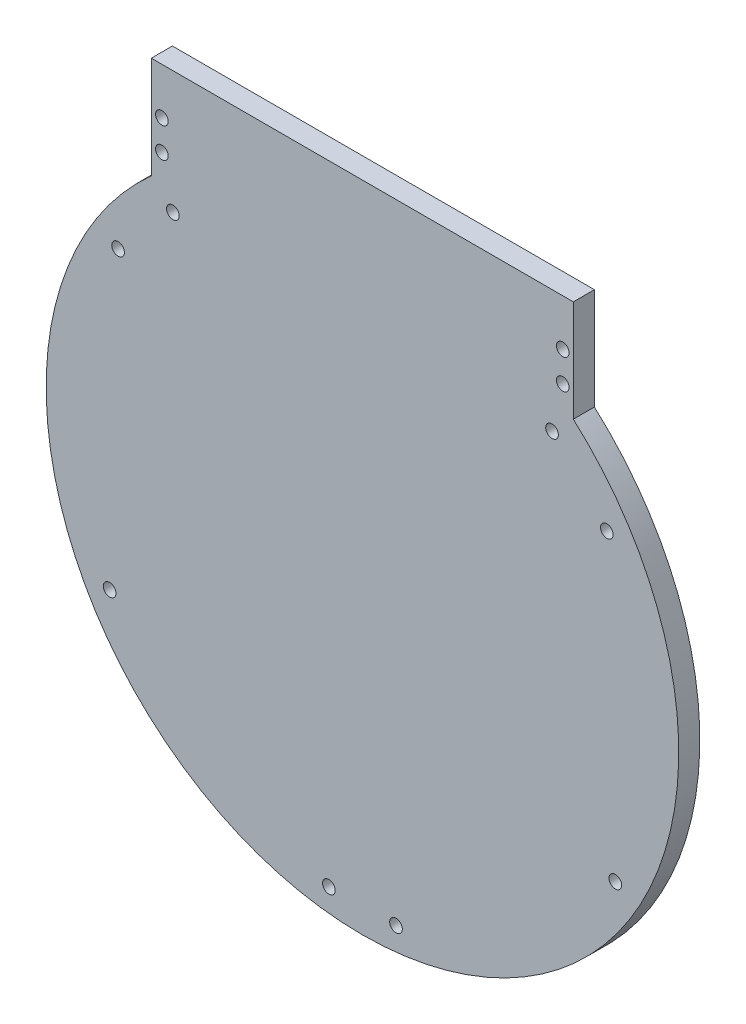
ISO-10303-21;
HEADER;
FILE_DESCRIPTION(('STEP AP214'),'2;1');
FILE_NAME('part.step','',(''),(''),'','','');
FILE_SCHEMA(('AUTOMOTIVE_DESIGN { 1 0 10303 214 1 1 1 1 }'));
ENDSEC;
DATA;
#1=APPLICATION_CONTEXT('core data for automotive mechanical design processes');
#2=APPLICATION_PROTOCOL_DEFINITION('international standard','automotive_design',2000,#1);
#3=PRODUCT_CONTEXT('',#1,'mechanical');
#4=PRODUCT('Part','Part','',(#3));
#5=PRODUCT_RELATED_PRODUCT_CATEGORY('part','',(#4));
#6=PRODUCT_DEFINITION_FORMATION('','',#4);
#7=PRODUCT_DEFINITION_CONTEXT('part definition',#1,'design');
#8=PRODUCT_DEFINITION('design','',#6,#7);
#9=PRODUCT_DEFINITION_SHAPE('','',#8);
#10=(LENGTH_UNIT() NAMED_UNIT(*) SI_UNIT(.MILLI.,.METRE.));
#11=(NAMED_UNIT(*) PLANE_ANGLE_UNIT() SI_UNIT($,.RADIAN.));
#12=(NAMED_UNIT(*) SI_UNIT($,.STERADIAN.) SOLID_ANGLE_UNIT());
#13=UNCERTAINTY_MEASURE_WITH_UNIT(LENGTH_MEASURE(1.E-05),#10,'distance_accuracy_value','');
#14=(GEOMETRIC_REPRESENTATION_CONTEXT(3) GLOBAL_UNCERTAINTY_ASSIGNED_CONTEXT((#13)) GLOBAL_UNIT_ASSIGNED_CONTEXT((#10,
#11,#12)) REPRESENTATION_CONTEXT('',''));
#15=CARTESIAN_POINT('',(0.,0.,0.));
#16=DIRECTION('',(0.,0.,1.));
#17=DIRECTION('',(1.,0.,0.));
#18=AXIS2_PLACEMENT_3D('',#15,#16,#17);
#19=CARTESIAN_POINT('',(-55.5045945388852,-168.430491325062,5.));
#20=DIRECTION('',(-0.478016960582072,-0.878350605052378,0.));
#21=DIRECTION('',(0.878350605052378,-0.478016960582072,0.));
#22=AXIS2_PLACEMENT_3D('',#19,#20,#21);
#23=PLANE('',#22);
#24=DIRECTION('',(-0.878350605052378,0.478016960582072,0.));
#25=VECTOR('',#24,1.);
#26=CARTESIAN_POINT('',(-55.5045945388852,-168.430491325062,0.));
#27=LINE('',#26,#25);
#28=CARTESIAN_POINT('',(-55.5045945388852,-168.430491325062,0.));
#29=VERTEX_POINT('',#28);
#30=CARTESIAN_POINT('',(-55.5733514009686,-168.393072387746,0.));
#31=VERTEX_POINT('',#30);
#32=EDGE_CURVE('E116',#29,#31,#27,.T.);
#33=ORIENTED_EDGE('',*,*,#32,.F.);
#34=DIRECTION('',(0.,0.,-1.));
#35=VECTOR('',#34,1.);
#36=CARTESIAN_POINT('',(-55.5045945388852,-168.430491325062,5.));
#37=LINE('',#36,#35);
#38=CARTESIAN_POINT('',(-55.5045945388852,-168.430491325062,5.));
#39=VERTEX_POINT('',#38);
#40=EDGE_CURVE('E11',#39,#29,#37,.T.);
#41=ORIENTED_EDGE('',*,*,#40,.F.);
#42=DIRECTION('',(-0.878350605052378,0.478016960582072,0.));
#43=VECTOR('',#42,1.);
#44=CARTESIAN_POINT('',(-55.5045945388852,-168.430491325062,5.));
#45=LINE('',#44,#43);
#46=CARTESIAN_POINT('',(-55.5733514009686,-168.393072387746,5.));
#47=VERTEX_POINT('',#46);
#48=EDGE_CURVE('E111',#39,#47,#45,.T.);
#49=ORIENTED_EDGE('',*,*,#48,.T.);
#50=DIRECTION('',(0.,0.,-1.));
#51=VECTOR('',#50,1.);
#52=CARTESIAN_POINT('',(-55.5733514009686,-168.393072387746,5.));
#53=LINE('',#52,#51);
#54=EDGE_CURVE('E81',#47,#31,#53,.T.);
#55=ORIENTED_EDGE('',*,*,#54,.T.);
#56=EDGE_LOOP('',(#33,#41,#49,#55));
#57=FACE_BOUND('',#56,.T.);
#58=ADVANCED_FACE('F36',(#57),#23,.T.);
#59=CARTESIAN_POINT('',(-5.50459453888519,-224.332190762557,5.));
#60=DIRECTION('',(0.,0.,-1.));
#61=DIRECTION('',(-1.,0.,0.));
#62=AXIS2_PLACEMENT_3D('',#59,#60,#61);
#63=CYLINDRICAL_SURFACE('',#62,75.);
#64=CARTESIAN_POINT('',(-5.50459453888519,-224.332190762557,0.));
#65=DIRECTION('',(0.,0.,1.));
#66=DIRECTION('',(1.,0.,0.));
#67=AXIS2_PLACEMENT_3D('',#64,#65,#66);
#68=CIRCLE('',#67,75.);
#69=CARTESIAN_POINT('',(44.4954054611148,-168.430491325062,0.));
#70=VERTEX_POINT('',#69);
#71=EDGE_CURVE('E72',#29,#70,#68,.T.);
#72=ORIENTED_EDGE('',*,*,#71,.T.);
#73=DIRECTION('',(0.,0.,-1.));
#74=VECTOR('',#73,1.);
#75=CARTESIAN_POINT('',(44.4954054611148,-168.430491325062,5.));
#76=LINE('',#75,#74);
#77=CARTESIAN_POINT('',(44.4954054611148,-168.430491325062,5.));
#78=VERTEX_POINT('',#77);
#79=EDGE_CURVE('E45',#78,#70,#76,.T.);
#80=ORIENTED_EDGE('',*,*,#79,.F.);
#81=CARTESIAN_POINT('',(-5.50459453888519,-224.332190762557,5.));
#82=DIRECTION('',(0.,0.,1.));
#83=DIRECTION('',(1.,0.,0.));
#84=AXIS2_PLACEMENT_3D('',#81,#82,#83);
#85=CIRCLE('',#84,75.);
#86=EDGE_CURVE('E95',#39,#78,#85,.T.);
#87=ORIENTED_EDGE('',*,*,#86,.F.);
#88=ORIENTED_EDGE('',*,*,#40,.T.);
#89=EDGE_LOOP('',(#72,#80,#87,#88));
#90=FACE_BOUND('',#89,.T.);
#91=ADVANCED_FACE('F181',(#90),#63,.T.);
#92=CARTESIAN_POINT('',(44.4954054611148,-168.430491325062,5.));
#93=DIRECTION('',(-1.,0.,0.));
#94=DIRECTION('',(0.,-1.,0.));
#95=AXIS2_PLACEMENT_3D('',#92,#93,#94);
#96=PLANE('',#95);
#97=DIRECTION('',(0.,1.,0.));
#98=VECTOR('',#97,1.);
#99=CARTESIAN_POINT('',(44.4954054611148,-168.430491325062,0.));
#100=LINE('',#99,#98);
#101=CARTESIAN_POINT('',(44.4954054611148,-144.332190762557,0.));
#102=VERTEX_POINT('',#101);
#103=EDGE_CURVE('E102',#70,#102,#100,.T.);
#104=ORIENTED_EDGE('',*,*,#103,.T.);
#105=DIRECTION('',(0.,0.,-1.));
#106=VECTOR('',#105,1.);
#107=CARTESIAN_POINT('',(44.4954054611148,-144.332190762557,5.));
#108=LINE('',#107,#106);
#109=CARTESIAN_POINT('',(44.4954054611148,-144.332190762557,5.));
#110=VERTEX_POINT('',#109);
#111=EDGE_CURVE('E99',#110,#102,#108,.T.);
#112=ORIENTED_EDGE('',*,*,#111,.F.);
#113=DIRECTION('',(0.,1.,0.));
#114=VECTOR('',#113,1.);
#115=CARTESIAN_POINT('',(44.4954054611148,-168.430491325062,5.));
#116=LINE('',#115,#114);
#117=EDGE_CURVE('E89',#78,#110,#116,.T.);
#118=ORIENTED_EDGE('',*,*,#117,.F.);
#119=ORIENTED_EDGE('',*,*,#79,.T.);
#120=EDGE_LOOP('',(#104,#112,#118,#119));
#121=FACE_BOUND('',#120,.T.);
#122=ADVANCED_FACE('F100',(#121),#96,.F.);
#123=CARTESIAN_POINT('',(-55.5733514009686,-144.332190762557,5.));
#124=DIRECTION('',(0.,1.,0.));
#125=DIRECTION('',(0.,0.,1.));
#126=AXIS2_PLACEMENT_3D('',#123,#124,#125);
#127=PLANE('',#126);
#128=DIRECTION('',(1.,0.,0.));
#129=VECTOR('',#128,1.);
#130=CARTESIAN_POINT('',(-55.5733514009686,-144.332190762557,0.));
#131=LINE('',#130,#129);
#132=CARTESIAN_POINT('',(-55.5733514009686,-144.332190762557,0.));
#133=VERTEX_POINT('',#132);
#134=EDGE_CURVE('E123',#133,#102,#131,.T.);
#135=ORIENTED_EDGE('',*,*,#134,.F.);
#136=DIRECTION('',(0.,0.,-1.));
#137=VECTOR('',#136,1.);
#138=CARTESIAN_POINT('',(-55.5733514009686,-144.332190762557,5.));
#139=LINE('',#138,#137);
#140=CARTESIAN_POINT('',(-55.5733514009686,-144.332190762557,5.));
#141=VERTEX_POINT('',#140);
#142=EDGE_CURVE('E106',#141,#133,#139,.T.);
#143=ORIENTED_EDGE('',*,*,#142,.F.);
#144=DIRECTION('',(1.,0.,0.));
#145=VECTOR('',#144,1.);
#146=CARTESIAN_POINT('',(-55.5733514009686,-144.332190762557,5.));
#147=LINE('',#146,#145);
#148=EDGE_CURVE('E94',#141,#110,#147,.T.);
#149=ORIENTED_EDGE('',*,*,#148,.T.);
#150=ORIENTED_EDGE('',*,*,#111,.T.);
#151=EDGE_LOOP('',(#135,#143,#149,#150));
#152=FACE_BOUND('',#151,.T.);
#153=ADVANCED_FACE('F108',(#152),#127,.T.);
#154=CARTESIAN_POINT('',(-55.5733514009686,-168.393072387746,5.));
#155=DIRECTION('',(-1.,0.,0.));
#156=DIRECTION('',(0.,0.,1.));
#157=AXIS2_PLACEMENT_3D('',#154,#155,#156);
#158=PLANE('',#157);
#159=DIRECTION('',(0.,1.,0.));
#160=VECTOR('',#159,1.);
#161=CARTESIAN_POINT('',(-55.5733514009686,-168.393072387746,0.));
#162=LINE('',#161,#160);
#163=EDGE_CURVE('E119',#31,#133,#162,.T.);
#164=ORIENTED_EDGE('',*,*,#163,.F.);
#165=ORIENTED_EDGE('',*,*,#54,.F.);
#166=DIRECTION('',(0.,1.,0.));
#167=VECTOR('',#166,1.);
#168=CARTESIAN_POINT('',(-55.5733514009686,-168.393072387746,5.));
#169=LINE('',#168,#167);
#170=EDGE_CURVE('E109',#47,#141,#169,.T.);
#171=ORIENTED_EDGE('',*,*,#170,.T.);
#172=ORIENTED_EDGE('',*,*,#142,.T.);
#173=EDGE_LOOP('',(#164,#165,#171,#172));
#174=FACE_BOUND('',#173,.T.);
#175=ADVANCED_FACE('F162',(#174),#158,.T.);
#176=CARTESIAN_POINT('',(-5.50459453888519,-224.332190762557,5.));
#177=DIRECTION('',(0.,0.,1.));
#178=DIRECTION('',(1.,0.,0.));
#179=AXIS2_PLACEMENT_3D('',#176,#177,#178);
#180=PLANE('',#179);
#181=CARTESIAN_POINT('',(-53.0733514009686,-155.332190762557,5.));
#182=DIRECTION('',(0.,0.,1.));
#183=DIRECTION('',(1.,0.,0.));
#184=AXIS2_PLACEMENT_3D('',#181,#182,#183);
#185=CIRCLE('',#184,1.5);
#186=CARTESIAN_POINT('',(-51.5733514009686,-155.332190762557,5.));
#187=VERTEX_POINT('',#186);
#188=EDGE_CURVE('E343',#187,#187,#185,.T.);
#189=ORIENTED_EDGE('',*,*,#188,.F.);
#190=EDGE_LOOP('',(#189));
#191=FACE_BOUND('',#190,.T.);
#192=CARTESIAN_POINT('',(41.9954054611148,-162.430491325062,5.));
#193=DIRECTION('',(0.,0.,1.));
#194=DIRECTION('',(1.,0.,0.));
#195=AXIS2_PLACEMENT_3D('',#192,#193,#194);
#196=CIRCLE('',#195,1.5);
#197=CARTESIAN_POINT('',(43.4954054611148,-162.430491325062,5.));
#198=VERTEX_POINT('',#197);
#199=EDGE_CURVE('E337',#198,#198,#196,.T.);
#200=ORIENTED_EDGE('',*,*,#199,.F.);
#201=EDGE_LOOP('',(#200));
#202=FACE_BOUND('',#201,.T.);
#203=CARTESIAN_POINT('',(41.9954054611148,-155.332190762557,5.));
#204=DIRECTION('',(0.,0.,1.));
#205=DIRECTION('',(1.,0.,0.));
#206=AXIS2_PLACEMENT_3D('',#203,#204,#205);
#207=CIRCLE('',#206,1.5);
#208=CARTESIAN_POINT('',(43.4954054611148,-155.332190762557,5.));
#209=VERTEX_POINT('',#208);
#210=EDGE_CURVE('E331',#209,#209,#207,.T.);
#211=ORIENTED_EDGE('',*,*,#210,.F.);
#212=EDGE_LOOP('',(#211));
#213=FACE_BOUND('',#212,.T.);
#214=CARTESIAN_POINT('',(-53.0733514009686,-162.430491325062,5.));
#215=DIRECTION('',(0.,0.,1.));
#216=DIRECTION('',(1.,0.,0.));
#217=AXIS2_PLACEMENT_3D('',#214,#215,#216);
#218=CIRCLE('',#217,1.5);
#219=CARTESIAN_POINT('',(-51.5733514009686,-162.430491325062,5.));
#220=VERTEX_POINT('',#219);
#221=EDGE_CURVE('E311',#220,#220,#218,.T.);
#222=ORIENTED_EDGE('',*,*,#221,.F.);
#223=EDGE_LOOP('',(#222));
#224=FACE_BOUND('',#223,.T.);
#225=CARTESIAN_POINT('',(-50.4554442576325,-173.430491325062,5.));
#226=DIRECTION('',(0.,0.,1.));
#227=DIRECTION('',(-1.,0.,0.));
#228=AXIS2_PLACEMENT_3D('',#225,#226,#227);
#229=CIRCLE('',#228,1.5);
#230=CARTESIAN_POINT('',(-51.9554442576325,-173.430491325062,5.));
#231=VERTEX_POINT('',#230);
#232=EDGE_CURVE('E316',#231,#231,#229,.T.);
#233=ORIENTED_EDGE('',*,*,#232,.F.);
#234=EDGE_LOOP('',(#233));
#235=FACE_BOUND('',#234,.T.);
#236=CARTESIAN_POINT('',(-63.4554442576325,-187.430491325062,5.));
#237=DIRECTION('',(0.,0.,1.));
#238=DIRECTION('',(-1.,0.,0.));
#239=AXIS2_PLACEMENT_3D('',#236,#237,#238);
#240=CIRCLE('',#239,1.50000000000001);
#241=CARTESIAN_POINT('',(-64.9554442576325,-187.430491325062,5.));
#242=VERTEX_POINT('',#241);
#243=EDGE_CURVE('E308',#242,#242,#240,.T.);
#244=ORIENTED_EDGE('',*,*,#243,.F.);
#245=EDGE_LOOP('',(#244));
#246=FACE_BOUND('',#245,.T.);
#247=CARTESIAN_POINT('',(-65.4554442576326,-258.430491325062,5.));
#248=DIRECTION('',(0.,0.,1.));
#249=DIRECTION('',(-1.,0.,0.));
#250=AXIS2_PLACEMENT_3D('',#247,#248,#249);
#251=CIRCLE('',#250,1.50000000000001);
#252=CARTESIAN_POINT('',(-66.9554442576326,-258.430491325062,5.));
#253=VERTEX_POINT('',#252);
#254=EDGE_CURVE('E304',#253,#253,#251,.T.);
#255=ORIENTED_EDGE('',*,*,#254,.F.);
#256=EDGE_LOOP('',(#255));
#257=FACE_BOUND('',#256,.T.);
#258=CARTESIAN_POINT('',(2.4462551798622,-293.430491325062,5.));
#259=DIRECTION('',(0.,0.,1.));
#260=DIRECTION('',(1.,0.,0.));
#261=AXIS2_PLACEMENT_3D('',#258,#259,#260);
#262=CIRCLE('',#261,1.5);
#263=CARTESIAN_POINT('',(3.9462551798622,-293.430491325062,5.));
#264=VERTEX_POINT('',#263);
#265=EDGE_CURVE('E301',#264,#264,#262,.T.);
#266=ORIENTED_EDGE('',*,*,#265,.F.);
#267=EDGE_LOOP('',(#266));
#268=FACE_BOUND('',#267,.T.);
#269=CARTESIAN_POINT('',(-13.4554442576326,-293.430491325062,5.));
#270=DIRECTION('',(0.,0.,1.));
#271=DIRECTION('',(-1.,0.,0.));
#272=AXIS2_PLACEMENT_3D('',#269,#270,#271);
#273=CIRCLE('',#272,1.5);
#274=CARTESIAN_POINT('',(-14.9554442576326,-293.430491325062,5.));
#275=VERTEX_POINT('',#274);
#276=EDGE_CURVE('E160',#275,#275,#273,.T.);
#277=ORIENTED_EDGE('',*,*,#276,.F.);
#278=EDGE_LOOP('',(#277));
#279=FACE_BOUND('',#278,.T.);
#280=CARTESIAN_POINT('',(54.4462551798622,-258.430491325062,5.));
#281=DIRECTION('',(0.,0.,1.));
#282=DIRECTION('',(1.,0.,0.));
#283=AXIS2_PLACEMENT_3D('',#280,#281,#282);
#284=CIRCLE('',#283,1.5);
#285=CARTESIAN_POINT('',(55.9462551798622,-258.430491325062,5.));
#286=VERTEX_POINT('',#285);
#287=EDGE_CURVE('E300',#286,#286,#284,.T.);
#288=ORIENTED_EDGE('',*,*,#287,.F.);
#289=EDGE_LOOP('',(#288));
#290=FACE_BOUND('',#289,.T.);
#291=CARTESIAN_POINT('',(52.4462551798622,-187.430491325062,5.));
#292=DIRECTION('',(0.,0.,1.));
#293=DIRECTION('',(1.,0.,0.));
#294=AXIS2_PLACEMENT_3D('',#291,#292,#293);
#295=CIRCLE('',#294,1.5);
#296=CARTESIAN_POINT('',(53.9462551798622,-187.430491325062,5.));
#297=VERTEX_POINT('',#296);
#298=EDGE_CURVE('E137',#297,#297,#295,.T.);
#299=ORIENTED_EDGE('',*,*,#298,.F.);
#300=EDGE_LOOP('',(#299));
#301=FACE_BOUND('',#300,.T.);
#302=CARTESIAN_POINT('',(39.4462551798622,-173.430491325062,5.));
#303=DIRECTION('',(0.,0.,1.));
#304=DIRECTION('',(1.,0.,0.));
#305=AXIS2_PLACEMENT_3D('',#302,#303,#304);
#306=CIRCLE('',#305,1.5);
#307=CARTESIAN_POINT('',(40.9462551798622,-173.430491325062,5.));
#308=VERTEX_POINT('',#307);
#309=EDGE_CURVE('E132',#308,#308,#306,.T.);
#310=ORIENTED_EDGE('',*,*,#309,.F.);
#311=EDGE_LOOP('',(#310));
#312=FACE_BOUND('',#311,.T.);
#313=ORIENTED_EDGE('',*,*,#48,.F.);
#314=ORIENTED_EDGE('',*,*,#86,.T.);
#315=ORIENTED_EDGE('',*,*,#117,.T.);
#316=ORIENTED_EDGE('',*,*,#148,.F.);
#317=ORIENTED_EDGE('',*,*,#170,.F.);
#318=EDGE_LOOP('',(#313,#314,#315,#316,#317));
#319=FACE_BOUND('',#318,.T.);
#320=ADVANCED_FACE('F92',(#191,#202,#213,#224,#235,#246,#257,#268,#279,#290,#301,#312,#319),
#180,.T.);
#321=CARTESIAN_POINT('',(-5.50459453888519,-224.332190762557,0.));
#322=DIRECTION('',(0.,0.,1.));
#323=DIRECTION('',(1.,0.,0.));
#324=AXIS2_PLACEMENT_3D('',#321,#322,#323);
#325=PLANE('',#324);
#326=CARTESIAN_POINT('',(-53.0733514009686,-155.332190762557,0.));
#327=DIRECTION('',(0.,0.,1.));
#328=DIRECTION('',(1.,0.,0.));
#329=AXIS2_PLACEMENT_3D('',#326,#327,#328);
#330=CIRCLE('',#329,1.5);
#331=CARTESIAN_POINT('',(-51.5733514009686,-155.332190762557,0.));
#332=VERTEX_POINT('',#331);
#333=EDGE_CURVE('E329',#332,#332,#330,.T.);
#334=ORIENTED_EDGE('',*,*,#333,.T.);
#335=EDGE_LOOP('',(#334));
#336=FACE_BOUND('',#335,.T.);
#337=CARTESIAN_POINT('',(41.9954054611148,-162.430491325062,0.));
#338=DIRECTION('',(0.,0.,1.));
#339=DIRECTION('',(1.,0.,0.));
#340=AXIS2_PLACEMENT_3D('',#337,#338,#339);
#341=CIRCLE('',#340,1.5);
#342=CARTESIAN_POINT('',(43.4954054611148,-162.430491325062,0.));
#343=VERTEX_POINT('',#342);
#344=EDGE_CURVE('E340',#343,#343,#341,.T.);
#345=ORIENTED_EDGE('',*,*,#344,.T.);
#346=EDGE_LOOP('',(#345));
#347=FACE_BOUND('',#346,.T.);
#348=CARTESIAN_POINT('',(41.9954054611148,-155.332190762557,0.));
#349=DIRECTION('',(0.,0.,1.));
#350=DIRECTION('',(1.,0.,0.));
#351=AXIS2_PLACEMENT_3D('',#348,#349,#350);
#352=CIRCLE('',#351,1.5);
#353=CARTESIAN_POINT('',(43.4954054611148,-155.332190762557,0.));
#354=VERTEX_POINT('',#353);
#355=EDGE_CURVE('E334',#354,#354,#352,.T.);
#356=ORIENTED_EDGE('',*,*,#355,.T.);
#357=EDGE_LOOP('',(#356));
#358=FACE_BOUND('',#357,.T.);
#359=CARTESIAN_POINT('',(-53.0733514009686,-162.430491325062,0.));
#360=DIRECTION('',(0.,0.,1.));
#361=DIRECTION('',(1.,0.,0.));
#362=AXIS2_PLACEMENT_3D('',#359,#360,#361);
#363=CIRCLE('',#362,1.5);
#364=CARTESIAN_POINT('',(-51.5733514009686,-162.430491325062,0.));
#365=VERTEX_POINT('',#364);
#366=EDGE_CURVE('E319',#365,#365,#363,.T.);
#367=ORIENTED_EDGE('',*,*,#366,.T.);
#368=EDGE_LOOP('',(#367));
#369=FACE_BOUND('',#368,.T.);
#370=CARTESIAN_POINT('',(-50.4554442576325,-173.430491325062,0.));
#371=DIRECTION('',(0.,0.,1.));
#372=DIRECTION('',(1.,0.,0.));
#373=AXIS2_PLACEMENT_3D('',#370,#371,#372);
#374=CIRCLE('',#373,1.5);
#375=CARTESIAN_POINT('',(-48.9554442576325,-173.430491325062,0.));
#376=VERTEX_POINT('',#375);
#377=EDGE_CURVE('E39',#376,#376,#374,.T.);
#378=ORIENTED_EDGE('',*,*,#377,.T.);
#379=EDGE_LOOP('',(#378));
#380=FACE_BOUND('',#379,.T.);
#381=CARTESIAN_POINT('',(-63.4554442576325,-187.430491325062,0.));
#382=DIRECTION('',(0.,0.,1.));
#383=DIRECTION('',(1.,0.,0.));
#384=AXIS2_PLACEMENT_3D('',#381,#382,#383);
#385=CIRCLE('',#384,1.50000000000001);
#386=CARTESIAN_POINT('',(-61.9554442576325,-187.430491325062,0.));
#387=VERTEX_POINT('',#386);
#388=EDGE_CURVE('E148',#387,#387,#385,.T.);
#389=ORIENTED_EDGE('',*,*,#388,.T.);
#390=EDGE_LOOP('',(#389));
#391=FACE_BOUND('',#390,.T.);
#392=CARTESIAN_POINT('',(-65.4554442576326,-258.430491325062,0.));
#393=DIRECTION('',(0.,0.,1.));
#394=DIRECTION('',(1.,0.,0.));
#395=AXIS2_PLACEMENT_3D('',#392,#393,#394);
#396=CIRCLE('',#395,1.50000000000001);
#397=CARTESIAN_POINT('',(-63.9554442576326,-258.430491325062,0.));
#398=VERTEX_POINT('',#397);
#399=EDGE_CURVE('E146',#398,#398,#396,.T.);
#400=ORIENTED_EDGE('',*,*,#399,.T.);
#401=EDGE_LOOP('',(#400));
#402=FACE_BOUND('',#401,.T.);
#403=CARTESIAN_POINT('',(2.4462551798622,-293.430491325062,0.));
#404=DIRECTION('',(0.,0.,1.));
#405=DIRECTION('',(1.,0.,0.));
#406=AXIS2_PLACEMENT_3D('',#403,#404,#405);
#407=CIRCLE('',#406,1.5);
#408=CARTESIAN_POINT('',(3.9462551798622,-293.430491325062,0.));
#409=VERTEX_POINT('',#408);
#410=EDGE_CURVE('E143',#409,#409,#407,.T.);
#411=ORIENTED_EDGE('',*,*,#410,.T.);
#412=EDGE_LOOP('',(#411));
#413=FACE_BOUND('',#412,.T.);
#414=CARTESIAN_POINT('',(-13.4554442576326,-293.430491325062,0.));
#415=DIRECTION('',(0.,0.,1.));
#416=DIRECTION('',(1.,0.,0.));
#417=AXIS2_PLACEMENT_3D('',#414,#415,#416);
#418=CIRCLE('',#417,1.5);
#419=CARTESIAN_POINT('',(-11.9554442576326,-293.430491325062,0.));
#420=VERTEX_POINT('',#419);
#421=EDGE_CURVE('E140',#420,#420,#418,.T.);
#422=ORIENTED_EDGE('',*,*,#421,.T.);
#423=EDGE_LOOP('',(#422));
#424=FACE_BOUND('',#423,.T.);
#425=CARTESIAN_POINT('',(54.4462551798622,-258.430491325062,0.));
#426=DIRECTION('',(0.,0.,1.));
#427=DIRECTION('',(1.,0.,0.));
#428=AXIS2_PLACEMENT_3D('',#425,#426,#427);
#429=CIRCLE('',#428,1.5);
#430=CARTESIAN_POINT('',(55.9462551798622,-258.430491325062,0.));
#431=VERTEX_POINT('',#430);
#432=EDGE_CURVE('E136',#431,#431,#429,.T.);
#433=ORIENTED_EDGE('',*,*,#432,.T.);
#434=EDGE_LOOP('',(#433));
#435=FACE_BOUND('',#434,.T.);
#436=CARTESIAN_POINT('',(52.4462551798622,-187.430491325062,0.));
#437=DIRECTION('',(0.,0.,1.));
#438=DIRECTION('',(1.,0.,0.));
#439=AXIS2_PLACEMENT_3D('',#436,#437,#438);
#440=CIRCLE('',#439,1.5);
#441=CARTESIAN_POINT('',(53.9462551798622,-187.430491325062,0.));
#442=VERTEX_POINT('',#441);
#443=EDGE_CURVE('E133',#442,#442,#440,.T.);
#444=ORIENTED_EDGE('',*,*,#443,.T.);
#445=EDGE_LOOP('',(#444));
#446=FACE_BOUND('',#445,.T.);
#447=CARTESIAN_POINT('',(39.4462551798622,-173.430491325062,0.));
#448=DIRECTION('',(0.,0.,1.));
#449=DIRECTION('',(1.,0.,0.));
#450=AXIS2_PLACEMENT_3D('',#447,#448,#449);
#451=CIRCLE('',#450,1.5);
#452=CARTESIAN_POINT('',(40.9462551798622,-173.430491325062,0.));
#453=VERTEX_POINT('',#452);
#454=EDGE_CURVE('E120',#453,#453,#451,.T.);
#455=ORIENTED_EDGE('',*,*,#454,.T.);
#456=EDGE_LOOP('',(#455));
#457=FACE_BOUND('',#456,.T.);
#458=ORIENTED_EDGE('',*,*,#32,.T.);
#459=ORIENTED_EDGE('',*,*,#163,.T.);
#460=ORIENTED_EDGE('',*,*,#134,.T.);
#461=ORIENTED_EDGE('',*,*,#103,.F.);
#462=ORIENTED_EDGE('',*,*,#71,.F.);
#463=EDGE_LOOP('',(#458,#459,#460,#461,#462));
#464=FACE_BOUND('',#463,.T.);
#465=ADVANCED_FACE('F164',(#336,#347,#358,#369,#380,#391,#402,#413,#424,#435,#446,#457,#464),
#325,.F.);
#466=CARTESIAN_POINT('',(39.4462551798622,-173.430491325062,-5.));
#467=DIRECTION('',(0.,0.,1.));
#468=DIRECTION('',(1.,0.,0.));
#469=AXIS2_PLACEMENT_3D('',#466,#467,#468);
#470=CYLINDRICAL_SURFACE('',#469,1.5);
#471=ORIENTED_EDGE('',*,*,#309,.T.);
#472=EDGE_LOOP('',(#471));
#473=FACE_BOUND('',#472,.T.);
#474=ORIENTED_EDGE('',*,*,#454,.F.);
#475=EDGE_LOOP('',(#474));
#476=FACE_BOUND('',#475,.T.);
#477=ADVANCED_FACE('F166',(#473,#476),#470,.F.);
#478=CARTESIAN_POINT('',(52.4462551798622,-187.430491325062,-5.));
#479=DIRECTION('',(0.,0.,1.));
#480=DIRECTION('',(1.,0.,0.));
#481=AXIS2_PLACEMENT_3D('',#478,#479,#480);
#482=CYLINDRICAL_SURFACE('',#481,1.5);
#483=ORIENTED_EDGE('',*,*,#298,.T.);
#484=EDGE_LOOP('',(#483));
#485=FACE_BOUND('',#484,.T.);
#486=ORIENTED_EDGE('',*,*,#443,.F.);
#487=EDGE_LOOP('',(#486));
#488=FACE_BOUND('',#487,.T.);
#489=ADVANCED_FACE('F173',(#485,#488),#482,.F.);
#490=CARTESIAN_POINT('',(54.4462551798622,-258.430491325062,-5.));
#491=DIRECTION('',(0.,0.,1.));
#492=DIRECTION('',(1.,0.,0.));
#493=AXIS2_PLACEMENT_3D('',#490,#491,#492);
#494=CYLINDRICAL_SURFACE('',#493,1.5);
#495=ORIENTED_EDGE('',*,*,#287,.T.);
#496=EDGE_LOOP('',(#495));
#497=FACE_BOUND('',#496,.T.);
#498=ORIENTED_EDGE('',*,*,#432,.F.);
#499=EDGE_LOOP('',(#498));
#500=FACE_BOUND('',#499,.T.);
#501=ADVANCED_FACE('F276',(#497,#500),#494,.F.);
#502=CARTESIAN_POINT('',(-13.4554442576326,-293.430491325062,-5.));
#503=DIRECTION('',(0.,0.,1.));
#504=DIRECTION('',(1.,0.,0.));
#505=AXIS2_PLACEMENT_3D('',#502,#503,#504);
#506=CYLINDRICAL_SURFACE('',#505,1.5);
#507=ORIENTED_EDGE('',*,*,#276,.T.);
#508=EDGE_LOOP('',(#507));
#509=FACE_BOUND('',#508,.T.);
#510=ORIENTED_EDGE('',*,*,#421,.F.);
#511=EDGE_LOOP('',(#510));
#512=FACE_BOUND('',#511,.T.);
#513=ADVANCED_FACE('F263',(#509,#512),#506,.F.);
#514=CARTESIAN_POINT('',(2.4462551798622,-293.430491325062,-5.));
#515=DIRECTION('',(0.,0.,1.));
#516=DIRECTION('',(1.,0.,0.));
#517=AXIS2_PLACEMENT_3D('',#514,#515,#516);
#518=CYLINDRICAL_SURFACE('',#517,1.5);
#519=ORIENTED_EDGE('',*,*,#265,.T.);
#520=EDGE_LOOP('',(#519));
#521=FACE_BOUND('',#520,.T.);
#522=ORIENTED_EDGE('',*,*,#410,.F.);
#523=EDGE_LOOP('',(#522));
#524=FACE_BOUND('',#523,.T.);
#525=ADVANCED_FACE('F259',(#521,#524),#518,.F.);
#526=CARTESIAN_POINT('',(-65.4554442576326,-258.430491325062,-5.));
#527=DIRECTION('',(0.,0.,1.));
#528=DIRECTION('',(1.,0.,0.));
#529=AXIS2_PLACEMENT_3D('',#526,#527,#528);
#530=CYLINDRICAL_SURFACE('',#529,1.50000000000001);
#531=ORIENTED_EDGE('',*,*,#254,.T.);
#532=EDGE_LOOP('',(#531));
#533=FACE_BOUND('',#532,.T.);
#534=ORIENTED_EDGE('',*,*,#399,.F.);
#535=EDGE_LOOP('',(#534));
#536=FACE_BOUND('',#535,.T.);
#537=ADVANCED_FACE('F262',(#533,#536),#530,.F.);
#538=CARTESIAN_POINT('',(-63.4554442576325,-187.430491325062,-5.));
#539=DIRECTION('',(0.,0.,1.));
#540=DIRECTION('',(1.,0.,0.));
#541=AXIS2_PLACEMENT_3D('',#538,#539,#540);
#542=CYLINDRICAL_SURFACE('',#541,1.50000000000001);
#543=ORIENTED_EDGE('',*,*,#243,.T.);
#544=EDGE_LOOP('',(#543));
#545=FACE_BOUND('',#544,.T.);
#546=ORIENTED_EDGE('',*,*,#388,.F.);
#547=EDGE_LOOP('',(#546));
#548=FACE_BOUND('',#547,.T.);
#549=ADVANCED_FACE('F267',(#545,#548),#542,.F.);
#550=CARTESIAN_POINT('',(-50.4554442576325,-173.430491325062,-5.));
#551=DIRECTION('',(0.,0.,1.));
#552=DIRECTION('',(1.,0.,0.));
#553=AXIS2_PLACEMENT_3D('',#550,#551,#552);
#554=CYLINDRICAL_SURFACE('',#553,1.5);
#555=ORIENTED_EDGE('',*,*,#232,.T.);
#556=EDGE_LOOP('',(#555));
#557=FACE_BOUND('',#556,.T.);
#558=ORIENTED_EDGE('',*,*,#377,.F.);
#559=EDGE_LOOP('',(#558));
#560=FACE_BOUND('',#559,.T.);
#561=ADVANCED_FACE('F207',(#557,#560),#554,.F.);
#562=CARTESIAN_POINT('',(-53.0733514009686,-162.430491325062,0.));
#563=DIRECTION('',(0.,0.,1.));
#564=DIRECTION('',(1.,0.,0.));
#565=AXIS2_PLACEMENT_3D('',#562,#563,#564);
#566=CYLINDRICAL_SURFACE('',#565,1.5);
#567=ORIENTED_EDGE('',*,*,#366,.F.);
#568=EDGE_LOOP('',(#567));
#569=FACE_BOUND('',#568,.T.);
#570=ORIENTED_EDGE('',*,*,#221,.T.);
#571=EDGE_LOOP('',(#570));
#572=FACE_BOUND('',#571,.T.);
#573=ADVANCED_FACE('F217',(#569,#572),#566,.F.);
#574=CARTESIAN_POINT('',(41.9954054611148,-155.332190762557,0.));
#575=DIRECTION('',(0.,0.,1.));
#576=DIRECTION('',(1.,0.,0.));
#577=AXIS2_PLACEMENT_3D('',#574,#575,#576);
#578=CYLINDRICAL_SURFACE('',#577,1.5);
#579=ORIENTED_EDGE('',*,*,#355,.F.);
#580=EDGE_LOOP('',(#579));
#581=FACE_BOUND('',#580,.T.);
#582=ORIENTED_EDGE('',*,*,#210,.T.);
#583=EDGE_LOOP('',(#582));
#584=FACE_BOUND('',#583,.T.);
#585=ADVANCED_FACE('F222',(#581,#584),#578,.F.);
#586=CARTESIAN_POINT('',(41.9954054611148,-162.430491325062,0.));
#587=DIRECTION('',(0.,0.,1.));
#588=DIRECTION('',(1.,0.,0.));
#589=AXIS2_PLACEMENT_3D('',#586,#587,#588);
#590=CYLINDRICAL_SURFACE('',#589,1.5);
#591=ORIENTED_EDGE('',*,*,#344,.F.);
#592=EDGE_LOOP('',(#591));
#593=FACE_BOUND('',#592,.T.);
#594=ORIENTED_EDGE('',*,*,#199,.T.);
#595=EDGE_LOOP('',(#594));
#596=FACE_BOUND('',#595,.T.);
#597=ADVANCED_FACE('F232',(#593,#596),#590,.F.);
#598=CARTESIAN_POINT('',(-53.0733514009686,-155.332190762557,0.));
#599=DIRECTION('',(0.,0.,1.));
#600=DIRECTION('',(1.,0.,0.));
#601=AXIS2_PLACEMENT_3D('',#598,#599,#600);
#602=CYLINDRICAL_SURFACE('',#601,1.5);
#603=ORIENTED_EDGE('',*,*,#333,.F.);
#604=EDGE_LOOP('',(#603));
#605=FACE_BOUND('',#604,.T.);
#606=ORIENTED_EDGE('',*,*,#188,.T.);
#607=EDGE_LOOP('',(#606));
#608=FACE_BOUND('',#607,.T.);
#609=ADVANCED_FACE('F242',(#605,#608),#602,.F.);
#610=CLOSED_SHELL('',(#58,#91,#122,#153,#175,#320,#465,#477,#489,#501,#513,#525,#537,#549,#561,
#573,#585,#597,#609));
#611=MANIFOLD_SOLID_BREP('B2',#610);
#612=ADVANCED_BREP_SHAPE_REPRESENTATION('',(#18,#611),#14);
#613=SHAPE_DEFINITION_REPRESENTATION(#9,#612);
ENDSEC;
END-ISO-10303-21;
